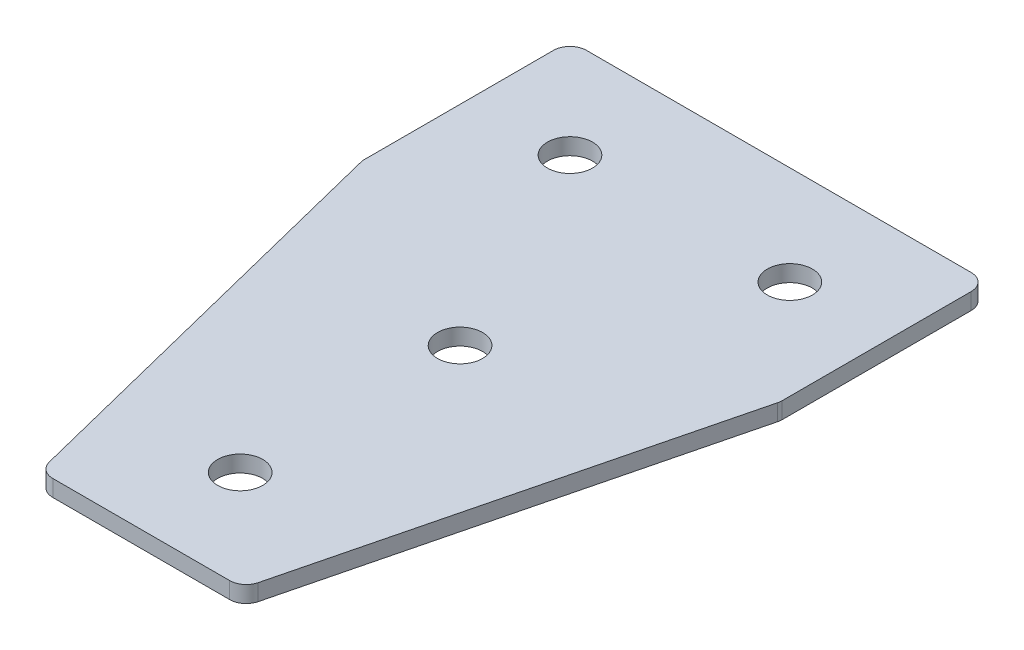
ISO-10303-21;
HEADER;
FILE_DESCRIPTION(('STEP AP214'),'2;1');
FILE_NAME('part.step','',(''),(''),'','','');
FILE_SCHEMA(('AUTOMOTIVE_DESIGN { 1 0 10303 214 1 1 1 1 }'));
ENDSEC;
DATA;
#1=APPLICATION_CONTEXT('core data for automotive mechanical design processes');
#2=APPLICATION_PROTOCOL_DEFINITION('international standard','automotive_design',2000,#1);
#3=PRODUCT_CONTEXT('',#1,'mechanical');
#4=PRODUCT('Part','Part','',(#3));
#5=PRODUCT_RELATED_PRODUCT_CATEGORY('part','',(#4));
#6=PRODUCT_DEFINITION_FORMATION('','',#4);
#7=PRODUCT_DEFINITION_CONTEXT('part definition',#1,'design');
#8=PRODUCT_DEFINITION('design','',#6,#7);
#9=PRODUCT_DEFINITION_SHAPE('','',#8);
#10=(LENGTH_UNIT() NAMED_UNIT(*) SI_UNIT(.MILLI.,.METRE.));
#11=(NAMED_UNIT(*) PLANE_ANGLE_UNIT() SI_UNIT($,.RADIAN.));
#12=(NAMED_UNIT(*) SI_UNIT($,.STERADIAN.) SOLID_ANGLE_UNIT());
#13=UNCERTAINTY_MEASURE_WITH_UNIT(LENGTH_MEASURE(1.E-05),#10,'distance_accuracy_value','');
#14=(GEOMETRIC_REPRESENTATION_CONTEXT(3) GLOBAL_UNCERTAINTY_ASSIGNED_CONTEXT((#13)) GLOBAL_UNIT_ASSIGNED_CONTEXT((#10,
#11,#12)) REPRESENTATION_CONTEXT('',''));
#15=CARTESIAN_POINT('',(0.,0.,0.));
#16=DIRECTION('',(0.,0.,1.));
#17=DIRECTION('',(1.,0.,0.));
#18=AXIS2_PLACEMENT_3D('',#15,#16,#17);
#19=CARTESIAN_POINT('',(-1.93702400832763,1.42462627726309,-40.9871269738255));
#20=DIRECTION('',(0.,-1.,0.));
#21=DIRECTION('',(0.,0.,-1.));
#22=AXIS2_PLACEMENT_3D('',#19,#20,#21);
#23=PLANE('',#22);
#24=CARTESIAN_POINT('',(-1.93702400832764,1.42462627726309,-0.98712697382549));
#25=DIRECTION('',(0.,1.,0.));
#26=DIRECTION('',(0.,0.,1.));
#27=AXIS2_PLACEMENT_3D('',#24,#25,#26);
#28=CIRCLE('',#27,4.1);
#29=CARTESIAN_POINT('',(-1.93702400832764,1.42462627726309,3.11287302617451));
#30=VERTEX_POINT('',#29);
#31=EDGE_CURVE('E171',#30,#30,#28,.T.);
#32=ORIENTED_EDGE('',*,*,#31,.T.);
#33=EDGE_LOOP('',(#32));
#34=FACE_BOUND('',#33,.T.);
#35=DIRECTION('',(1.,0.,0.));
#36=VECTOR('',#35,1.);
#37=CARTESIAN_POINT('',(-19.9370240083276,1.42462627726309,57.0128730261745));
#38=LINE('',#37,#36);
#39=CARTESIAN_POINT('',(-18.0331419763055,1.42462627726309,57.0128730261745));
#40=VERTEX_POINT('',#39);
#41=CARTESIAN_POINT('',(14.1590939596503,1.42462627726309,57.0128730261745));
#42=VERTEX_POINT('',#41);
#43=EDGE_CURVE('E189',#40,#42,#38,.T.);
#44=ORIENTED_EDGE('',*,*,#43,.F.);
#45=CARTESIAN_POINT('',(-18.0331419763055,1.42462627726309,54.0128730261745));
#46=DIRECTION('',(0.,1.,0.));
#47=DIRECTION('',(0.,0.,-1.));
#48=AXIS2_PLACEMENT_3D('',#45,#46,#47);
#49=CIRCLE('',#48,3.);
#50=CARTESIAN_POINT('',(-20.9435694767415,1.42462627726309,54.7404799012835));
#51=VERTEX_POINT('',#50);
#52=EDGE_CURVE('E155',#51,#40,#49,.T.);
#53=ORIENTED_EDGE('',*,*,#52,.F.);
#54=DIRECTION('',(-0.242535625036334,0.,-0.970142500145332));
#55=VECTOR('',#54,1.);
#56=CARTESIAN_POINT('',(-20.3754711955187,1.42462627726309,57.0128730261745));
#57=LINE('',#56,#55);
#58=CARTESIAN_POINT('',(-39.8474515087636,1.42462627726309,-20.8750482268048));
#59=VERTEX_POINT('',#58);
#60=EDGE_CURVE('E142',#51,#59,#57,.T.);
#61=ORIENTED_EDGE('',*,*,#60,.T.);
#62=CARTESIAN_POINT('',(-36.9370240083276,1.42462627726309,-21.6026551019138));
#63=DIRECTION('',(0.,1.,0.));
#64=DIRECTION('',(0.,0.,-1.));
#65=AXIS2_PLACEMENT_3D('',#62,#63,#64);
#66=CIRCLE('',#65,3.);
#67=CARTESIAN_POINT('',(-39.9370240083276,1.42462627726309,-21.6026551019138));
#68=VERTEX_POINT('',#67);
#69=EDGE_CURVE('E153',#68,#59,#66,.T.);
#70=ORIENTED_EDGE('',*,*,#69,.F.);
#71=DIRECTION('',(0.,0.,-1.));
#72=VECTOR('',#71,1.);
#73=CARTESIAN_POINT('',(-39.9370240083276,1.42462627726309,-21.2333382250608));
#74=LINE('',#73,#72);
#75=CARTESIAN_POINT('',(-39.9370240083276,1.42462627726309,-55.9871269738255));
#76=VERTEX_POINT('',#75);
#77=EDGE_CURVE('E124',#68,#76,#74,.T.);
#78=ORIENTED_EDGE('',*,*,#77,.T.);
#79=CARTESIAN_POINT('',(-36.9370240083276,1.42462627726309,-55.9871269738255));
#80=DIRECTION('',(0.,1.,0.));
#81=DIRECTION('',(0.,0.,-1.));
#82=AXIS2_PLACEMENT_3D('',#79,#80,#81);
#83=CIRCLE('',#82,3.);
#84=CARTESIAN_POINT('',(-36.9370240083276,1.42462627726309,-58.9871269738255));
#85=VERTEX_POINT('',#84);
#86=EDGE_CURVE('E150',#85,#76,#83,.T.);
#87=ORIENTED_EDGE('',*,*,#86,.F.);
#88=DIRECTION('',(-1.,0.,0.));
#89=VECTOR('',#88,1.);
#90=CARTESIAN_POINT('',(36.0629759916724,1.42462627726309,-58.9871269738255));
#91=LINE('',#90,#89);
#92=CARTESIAN_POINT('',(33.0629759916724,1.42462627726309,-58.9871269738255));
#93=VERTEX_POINT('',#92);
#94=EDGE_CURVE('E186',#93,#85,#91,.T.);
#95=ORIENTED_EDGE('',*,*,#94,.F.);
#96=CARTESIAN_POINT('',(33.0629759916724,1.42462627726309,-55.9871269738255));
#97=DIRECTION('',(0.,-1.,0.));
#98=DIRECTION('',(0.,0.,-1.));
#99=AXIS2_PLACEMENT_3D('',#96,#97,#98);
#100=CIRCLE('',#99,3.);
#101=CARTESIAN_POINT('',(36.0629759916724,1.42462627726309,-55.9871269738255));
#102=VERTEX_POINT('',#101);
#103=EDGE_CURVE('E210',#93,#102,#100,.T.);
#104=ORIENTED_EDGE('',*,*,#103,.T.);
#105=DIRECTION('',(0.,0.,-1.));
#106=VECTOR('',#105,1.);
#107=CARTESIAN_POINT('',(36.0629759916724,1.42462627726309,-21.2333382250608));
#108=LINE('',#107,#106);
#109=CARTESIAN_POINT('',(36.0629759916724,1.42462627726309,-21.6026551019138));
#110=VERTEX_POINT('',#109);
#111=EDGE_CURVE('E183',#110,#102,#108,.T.);
#112=ORIENTED_EDGE('',*,*,#111,.F.);
#113=CARTESIAN_POINT('',(33.0629759916724,1.42462627726309,-21.6026551019138));
#114=DIRECTION('',(0.,-1.,0.));
#115=DIRECTION('',(0.,0.,-1.));
#116=AXIS2_PLACEMENT_3D('',#113,#114,#115);
#117=CIRCLE('',#116,3.);
#118=CARTESIAN_POINT('',(35.9734034921084,1.42462627726309,-20.8750482268048));
#119=VERTEX_POINT('',#118);
#120=EDGE_CURVE('E31',#110,#119,#117,.T.);
#121=ORIENTED_EDGE('',*,*,#120,.T.);
#122=DIRECTION('',(0.242535625036333,0.,-0.970142500145332));
#123=VECTOR('',#122,1.);
#124=CARTESIAN_POINT('',(16.5014231788635,1.42462627726309,57.0128730261745));
#125=LINE('',#124,#123);
#126=CARTESIAN_POINT('',(17.0695214600863,1.42462627726309,54.7404799012835));
#127=VERTEX_POINT('',#126);
#128=EDGE_CURVE('E191',#127,#119,#125,.T.);
#129=ORIENTED_EDGE('',*,*,#128,.F.);
#130=CARTESIAN_POINT('',(14.1590939596503,1.42462627726309,54.0128730261745));
#131=DIRECTION('',(0.,-1.,0.));
#132=DIRECTION('',(0.,0.,-1.));
#133=AXIS2_PLACEMENT_3D('',#130,#131,#132);
#134=CIRCLE('',#133,3.);
#135=EDGE_CURVE('E213',#127,#42,#134,.T.);
#136=ORIENTED_EDGE('',*,*,#135,.T.);
#137=EDGE_LOOP('',(#44,#53,#61,#70,#78,#87,#95,#104,#112,#121,#129,#136));
#138=FACE_BOUND('',#137,.T.);
#139=CARTESIAN_POINT('',(-1.93702400832764,1.42462627726309,39.0128730261745));
#140=DIRECTION('',(0.,1.,0.));
#141=DIRECTION('',(0.,0.,1.));
#142=AXIS2_PLACEMENT_3D('',#139,#140,#141);
#143=CIRCLE('',#142,4.1);
#144=CARTESIAN_POINT('',(-1.93702400832764,1.42462627726309,43.1128730261745));
#145=VERTEX_POINT('',#144);
#146=EDGE_CURVE('E165',#145,#145,#143,.T.);
#147=ORIENTED_EDGE('',*,*,#146,.T.);
#148=EDGE_LOOP('',(#147));
#149=FACE_BOUND('',#148,.T.);
#150=CARTESIAN_POINT('',(18.0629759916724,1.42462627726309,-40.9871269738255));
#151=DIRECTION('',(0.,1.,0.));
#152=DIRECTION('',(0.,0.,1.));
#153=AXIS2_PLACEMENT_3D('',#150,#151,#152);
#154=CIRCLE('',#153,4.1);
#155=CARTESIAN_POINT('',(18.0629759916724,1.42462627726309,-36.8871269738255));
#156=VERTEX_POINT('',#155);
#157=EDGE_CURVE('E177',#156,#156,#154,.T.);
#158=ORIENTED_EDGE('',*,*,#157,.T.);
#159=EDGE_LOOP('',(#158));
#160=FACE_BOUND('',#159,.T.);
#161=CARTESIAN_POINT('',(-21.9370240083276,1.42462627726309,-40.9871269738255));
#162=DIRECTION('',(0.,-1.,0.));
#163=DIRECTION('',(0.,0.,1.));
#164=AXIS2_PLACEMENT_3D('',#161,#162,#163);
#165=CIRCLE('',#164,4.1);
#166=CARTESIAN_POINT('',(-21.9370240083276,1.42462627726309,-36.8871269738255));
#167=VERTEX_POINT('',#166);
#168=EDGE_CURVE('E135',#167,#167,#165,.T.);
#169=ORIENTED_EDGE('',*,*,#168,.F.);
#170=EDGE_LOOP('',(#169));
#171=FACE_BOUND('',#170,.T.);
#172=ADVANCED_FACE('F16',(#34,#138,#149,#160,#171),#23,.T.);
#173=CARTESIAN_POINT('',(36.0629759916724,1.42462627726309,-21.2333382250608));
#174=DIRECTION('',(1.,0.,0.));
#175=DIRECTION('',(0.,0.,-1.));
#176=AXIS2_PLACEMENT_3D('',#173,#174,#175);
#177=PLANE('',#176);
#178=DIRECTION('',(0.,0.,-1.));
#179=VECTOR('',#178,1.);
#180=CARTESIAN_POINT('',(36.0629759916724,4.42462627726309,-21.2333382250608));
#181=LINE('',#180,#179);
#182=CARTESIAN_POINT('',(36.0629759916724,4.42462627726309,-21.6026551019138));
#183=VERTEX_POINT('',#182);
#184=CARTESIAN_POINT('',(36.0629759916724,4.42462627726309,-55.9871269738255));
#185=VERTEX_POINT('',#184);
#186=EDGE_CURVE('E180',#183,#185,#181,.T.);
#187=ORIENTED_EDGE('',*,*,#186,.F.);
#188=DIRECTION('',(0.,1.,0.));
#189=VECTOR('',#188,1.);
#190=CARTESIAN_POINT('',(36.0629759916724,1.42462627726309,-21.6026551019138));
#191=LINE('',#190,#189);
#192=EDGE_CURVE('E24',#183,#110,#191,.F.);
#193=ORIENTED_EDGE('',*,*,#192,.T.);
#194=ORIENTED_EDGE('',*,*,#111,.T.);
#195=DIRECTION('',(0.,1.,0.));
#196=VECTOR('',#195,1.);
#197=CARTESIAN_POINT('',(36.0629759916724,1.42462627726309,-55.9871269738255));
#198=LINE('',#197,#196);
#199=EDGE_CURVE('E220',#102,#185,#198,.T.);
#200=ORIENTED_EDGE('',*,*,#199,.T.);
#201=EDGE_LOOP('',(#187,#193,#194,#200));
#202=FACE_BOUND('',#201,.T.);
#203=ADVANCED_FACE('F225',(#202),#177,.T.);
#204=CARTESIAN_POINT('',(16.5014231788635,1.42462627726309,57.0128730261745));
#205=DIRECTION('',(0.970142500145332,0.,0.242535625036333));
#206=DIRECTION('',(0.242535625036333,0.,-0.970142500145332));
#207=AXIS2_PLACEMENT_3D('',#204,#205,#206);
#208=PLANE('',#207);
#209=DIRECTION('',(0.242535625036333,0.,-0.970142500145332));
#210=VECTOR('',#209,1.);
#211=CARTESIAN_POINT('',(16.5014231788635,4.42462627726309,57.0128730261745));
#212=LINE('',#211,#210);
#213=CARTESIAN_POINT('',(17.0695214600863,4.42462627726309,54.7404799012835));
#214=VERTEX_POINT('',#213);
#215=CARTESIAN_POINT('',(35.9734034921084,4.42462627726309,-20.8750482268048));
#216=VERTEX_POINT('',#215);
#217=EDGE_CURVE('E187',#214,#216,#212,.T.);
#218=ORIENTED_EDGE('',*,*,#217,.F.);
#219=DIRECTION('',(0.,1.,0.));
#220=VECTOR('',#219,1.);
#221=CARTESIAN_POINT('',(17.0695214600863,1.42462627726309,54.7404799012835));
#222=LINE('',#221,#220);
#223=EDGE_CURVE('E38',#214,#127,#222,.F.);
#224=ORIENTED_EDGE('',*,*,#223,.T.);
#225=ORIENTED_EDGE('',*,*,#128,.T.);
#226=DIRECTION('',(0.,1.,0.));
#227=VECTOR('',#226,1.);
#228=CARTESIAN_POINT('',(35.9734034921084,1.42462627726309,-20.8750482268048));
#229=LINE('',#228,#227);
#230=EDGE_CURVE('E216',#119,#216,#229,.T.);
#231=ORIENTED_EDGE('',*,*,#230,.T.);
#232=EDGE_LOOP('',(#218,#224,#225,#231));
#233=FACE_BOUND('',#232,.T.);
#234=ADVANCED_FACE('F233',(#233),#208,.T.);
#235=CARTESIAN_POINT('',(-19.9370240083276,1.42462627726309,57.0128730261745));
#236=DIRECTION('',(0.,0.,1.));
#237=DIRECTION('',(1.,0.,0.));
#238=AXIS2_PLACEMENT_3D('',#235,#236,#237);
#239=PLANE('',#238);
#240=DIRECTION('',(1.,0.,0.));
#241=VECTOR('',#240,1.);
#242=CARTESIAN_POINT('',(-19.9370240083276,4.42462627726309,57.0128730261745));
#243=LINE('',#242,#241);
#244=CARTESIAN_POINT('',(-18.0331419763055,4.42462627726309,57.0128730261745));
#245=VERTEX_POINT('',#244);
#246=CARTESIAN_POINT('',(14.1590939596503,4.42462627726309,57.0128730261745));
#247=VERTEX_POINT('',#246);
#248=EDGE_CURVE('E198',#245,#247,#243,.T.);
#249=ORIENTED_EDGE('',*,*,#248,.F.);
#250=DIRECTION('',(0.,1.,0.));
#251=VECTOR('',#250,1.);
#252=CARTESIAN_POINT('',(-18.0331419763055,1.42462627726309,57.0128730261745));
#253=LINE('',#252,#251);
#254=EDGE_CURVE('E147',#40,#245,#253,.T.);
#255=ORIENTED_EDGE('',*,*,#254,.F.);
#256=ORIENTED_EDGE('',*,*,#43,.T.);
#257=DIRECTION('',(0.,1.,0.));
#258=VECTOR('',#257,1.);
#259=CARTESIAN_POINT('',(14.1590939596503,1.42462627726309,57.0128730261745));
#260=LINE('',#259,#258);
#261=EDGE_CURVE('E207',#42,#247,#260,.T.);
#262=ORIENTED_EDGE('',*,*,#261,.T.);
#263=EDGE_LOOP('',(#249,#255,#256,#262));
#264=FACE_BOUND('',#263,.T.);
#265=ADVANCED_FACE('F240',(#264),#239,.T.);
#266=CARTESIAN_POINT('',(36.0629759916724,1.42462627726309,-58.9871269738255));
#267=DIRECTION('',(0.,0.,-1.));
#268=DIRECTION('',(-1.,0.,0.));
#269=AXIS2_PLACEMENT_3D('',#266,#267,#268);
#270=PLANE('',#269);
#271=ORIENTED_EDGE('',*,*,#94,.T.);
#272=DIRECTION('',(0.,1.,0.));
#273=VECTOR('',#272,1.);
#274=CARTESIAN_POINT('',(-36.9370240083276,1.42462627726309,-58.9871269738255));
#275=LINE('',#274,#273);
#276=CARTESIAN_POINT('',(-36.9370240083276,4.42462627726309,-58.9871269738255));
#277=VERTEX_POINT('',#276);
#278=EDGE_CURVE('E126',#277,#85,#275,.F.);
#279=ORIENTED_EDGE('',*,*,#278,.F.);
#280=DIRECTION('',(-1.,0.,0.));
#281=VECTOR('',#280,1.);
#282=CARTESIAN_POINT('',(36.0629759916724,4.42462627726309,-58.9871269738255));
#283=LINE('',#282,#281);
#284=CARTESIAN_POINT('',(33.0629759916724,4.42462627726309,-58.9871269738255));
#285=VERTEX_POINT('',#284);
#286=EDGE_CURVE('E196',#285,#277,#283,.T.);
#287=ORIENTED_EDGE('',*,*,#286,.F.);
#288=DIRECTION('',(0.,1.,0.));
#289=VECTOR('',#288,1.);
#290=CARTESIAN_POINT('',(33.0629759916724,1.42462627726309,-58.9871269738255));
#291=LINE('',#290,#289);
#292=EDGE_CURVE('E10',#285,#93,#291,.F.);
#293=ORIENTED_EDGE('',*,*,#292,.T.);
#294=EDGE_LOOP('',(#271,#279,#287,#293));
#295=FACE_BOUND('',#294,.T.);
#296=ADVANCED_FACE('F294',(#295),#270,.T.);
#297=CARTESIAN_POINT('',(-1.93702400832763,4.42462627726309,-40.9871269738255));
#298=DIRECTION('',(0.,-1.,0.));
#299=DIRECTION('',(0.,0.,-1.));
#300=AXIS2_PLACEMENT_3D('',#297,#298,#299);
#301=PLANE('',#300);
#302=CARTESIAN_POINT('',(-1.93702400832764,4.42462627726309,-0.98712697382549));
#303=DIRECTION('',(0.,1.,0.));
#304=DIRECTION('',(0.,0.,1.));
#305=AXIS2_PLACEMENT_3D('',#302,#303,#304);
#306=CIRCLE('',#305,4.1);
#307=CARTESIAN_POINT('',(-1.93702400832764,4.42462627726309,3.11287302617451));
#308=VERTEX_POINT('',#307);
#309=EDGE_CURVE('E168',#308,#308,#306,.T.);
#310=ORIENTED_EDGE('',*,*,#309,.F.);
#311=EDGE_LOOP('',(#310));
#312=FACE_BOUND('',#311,.T.);
#313=CARTESIAN_POINT('',(-18.0331419763055,4.42462627726309,54.0128730261745));
#314=DIRECTION('',(0.,1.,0.));
#315=DIRECTION('',(0.,0.,-1.));
#316=AXIS2_PLACEMENT_3D('',#313,#314,#315);
#317=CIRCLE('',#316,3.);
#318=CARTESIAN_POINT('',(-20.9435694767415,4.42462627726309,54.7404799012835));
#319=VERTEX_POINT('',#318);
#320=EDGE_CURVE('E116',#245,#319,#317,.F.);
#321=ORIENTED_EDGE('',*,*,#320,.F.);
#322=ORIENTED_EDGE('',*,*,#248,.T.);
#323=CARTESIAN_POINT('',(14.1590939596503,4.42462627726309,54.0128730261745));
#324=DIRECTION('',(0.,-1.,0.));
#325=DIRECTION('',(0.,0.,-1.));
#326=AXIS2_PLACEMENT_3D('',#323,#324,#325);
#327=CIRCLE('',#326,3.);
#328=EDGE_CURVE('E205',#247,#214,#327,.F.);
#329=ORIENTED_EDGE('',*,*,#328,.T.);
#330=ORIENTED_EDGE('',*,*,#217,.T.);
#331=CARTESIAN_POINT('',(33.0629759916724,4.42462627726309,-21.6026551019138));
#332=DIRECTION('',(0.,-1.,0.));
#333=DIRECTION('',(0.,0.,-1.));
#334=AXIS2_PLACEMENT_3D('',#331,#332,#333);
#335=CIRCLE('',#334,3.);
#336=EDGE_CURVE('E203',#216,#183,#335,.F.);
#337=ORIENTED_EDGE('',*,*,#336,.T.);
#338=ORIENTED_EDGE('',*,*,#186,.T.);
#339=CARTESIAN_POINT('',(33.0629759916724,4.42462627726309,-55.9871269738255));
#340=DIRECTION('',(0.,-1.,0.));
#341=DIRECTION('',(0.,0.,-1.));
#342=AXIS2_PLACEMENT_3D('',#339,#340,#341);
#343=CIRCLE('',#342,3.);
#344=EDGE_CURVE('E193',#185,#285,#343,.F.);
#345=ORIENTED_EDGE('',*,*,#344,.T.);
#346=ORIENTED_EDGE('',*,*,#286,.T.);
#347=CARTESIAN_POINT('',(-36.9370240083276,4.42462627726309,-55.9871269738255));
#348=DIRECTION('',(0.,1.,0.));
#349=DIRECTION('',(0.,0.,-1.));
#350=AXIS2_PLACEMENT_3D('',#347,#348,#349);
#351=CIRCLE('',#350,3.);
#352=CARTESIAN_POINT('',(-39.9370240083276,4.42462627726309,-55.9871269738255));
#353=VERTEX_POINT('',#352);
#354=EDGE_CURVE('E117',#353,#277,#351,.F.);
#355=ORIENTED_EDGE('',*,*,#354,.F.);
#356=DIRECTION('',(0.,0.,-1.));
#357=VECTOR('',#356,1.);
#358=CARTESIAN_POINT('',(-39.9370240083276,4.42462627726309,-21.2333382250608));
#359=LINE('',#358,#357);
#360=CARTESIAN_POINT('',(-39.9370240083276,4.42462627726309,-21.6026551019138));
#361=VERTEX_POINT('',#360);
#362=EDGE_CURVE('E122',#361,#353,#359,.T.);
#363=ORIENTED_EDGE('',*,*,#362,.F.);
#364=CARTESIAN_POINT('',(-36.9370240083276,4.42462627726309,-21.6026551019138));
#365=DIRECTION('',(0.,1.,0.));
#366=DIRECTION('',(0.,0.,-1.));
#367=AXIS2_PLACEMENT_3D('',#364,#365,#366);
#368=CIRCLE('',#367,3.);
#369=CARTESIAN_POINT('',(-39.8474515087636,4.42462627726309,-20.8750482268048));
#370=VERTEX_POINT('',#369);
#371=EDGE_CURVE('E105',#370,#361,#368,.F.);
#372=ORIENTED_EDGE('',*,*,#371,.F.);
#373=DIRECTION('',(-0.242535625036334,0.,-0.970142500145332));
#374=VECTOR('',#373,1.);
#375=CARTESIAN_POINT('',(-20.3754711955187,4.42462627726309,57.0128730261745));
#376=LINE('',#375,#374);
#377=EDGE_CURVE('E134',#319,#370,#376,.T.);
#378=ORIENTED_EDGE('',*,*,#377,.F.);
#379=EDGE_LOOP('',(#321,#322,#329,#330,#337,#338,#345,#346,#355,#363,#372,#378));
#380=FACE_BOUND('',#379,.T.);
#381=CARTESIAN_POINT('',(-1.93702400832764,4.42462627726309,39.0128730261745));
#382=DIRECTION('',(0.,1.,0.));
#383=DIRECTION('',(0.,0.,1.));
#384=AXIS2_PLACEMENT_3D('',#381,#382,#383);
#385=CIRCLE('',#384,4.1);
#386=CARTESIAN_POINT('',(-1.93702400832764,4.42462627726309,43.1128730261745));
#387=VERTEX_POINT('',#386);
#388=EDGE_CURVE('E164',#387,#387,#385,.T.);
#389=ORIENTED_EDGE('',*,*,#388,.F.);
#390=EDGE_LOOP('',(#389));
#391=FACE_BOUND('',#390,.T.);
#392=CARTESIAN_POINT('',(18.0629759916724,4.42462627726309,-40.9871269738255));
#393=DIRECTION('',(0.,1.,0.));
#394=DIRECTION('',(0.,0.,1.));
#395=AXIS2_PLACEMENT_3D('',#392,#393,#394);
#396=CIRCLE('',#395,4.1);
#397=CARTESIAN_POINT('',(18.0629759916724,4.42462627726309,-36.8871269738255));
#398=VERTEX_POINT('',#397);
#399=EDGE_CURVE('E174',#398,#398,#396,.T.);
#400=ORIENTED_EDGE('',*,*,#399,.F.);
#401=EDGE_LOOP('',(#400));
#402=FACE_BOUND('',#401,.T.);
#403=CARTESIAN_POINT('',(-21.9370240083276,4.42462627726309,-40.9871269738255));
#404=DIRECTION('',(0.,-1.,0.));
#405=DIRECTION('',(0.,0.,1.));
#406=AXIS2_PLACEMENT_3D('',#403,#404,#405);
#407=CIRCLE('',#406,4.1);
#408=CARTESIAN_POINT('',(-21.9370240083276,4.42462627726309,-36.8871269738255));
#409=VERTEX_POINT('',#408);
#410=EDGE_CURVE('E139',#409,#409,#407,.T.);
#411=ORIENTED_EDGE('',*,*,#410,.T.);
#412=EDGE_LOOP('',(#411));
#413=FACE_BOUND('',#412,.T.);
#414=ADVANCED_FACE('F130',(#312,#380,#391,#402,#413),#301,.F.);
#415=CARTESIAN_POINT('',(14.1590939596503,1.42462627726309,54.0128730261745));
#416=DIRECTION('',(0.,1.,0.));
#417=DIRECTION('',(0.,0.,1.));
#418=AXIS2_PLACEMENT_3D('',#415,#416,#417);
#419=CYLINDRICAL_SURFACE('',#418,3.);
#420=ORIENTED_EDGE('',*,*,#135,.F.);
#421=ORIENTED_EDGE('',*,*,#223,.F.);
#422=ORIENTED_EDGE('',*,*,#328,.F.);
#423=ORIENTED_EDGE('',*,*,#261,.F.);
#424=EDGE_LOOP('',(#420,#421,#422,#423));
#425=FACE_BOUND('',#424,.T.);
#426=ADVANCED_FACE('F238',(#425),#419,.T.);
#427=CARTESIAN_POINT('',(33.0629759916724,1.42462627726309,-21.6026551019138));
#428=DIRECTION('',(0.,1.,0.));
#429=DIRECTION('',(0.,0.,1.));
#430=AXIS2_PLACEMENT_3D('',#427,#428,#429);
#431=CYLINDRICAL_SURFACE('',#430,3.);
#432=ORIENTED_EDGE('',*,*,#120,.F.);
#433=ORIENTED_EDGE('',*,*,#192,.F.);
#434=ORIENTED_EDGE('',*,*,#336,.F.);
#435=ORIENTED_EDGE('',*,*,#230,.F.);
#436=EDGE_LOOP('',(#432,#433,#434,#435));
#437=FACE_BOUND('',#436,.T.);
#438=ADVANCED_FACE('F232',(#437),#431,.T.);
#439=CARTESIAN_POINT('',(33.0629759916724,1.42462627726309,-55.9871269738255));
#440=DIRECTION('',(0.,1.,0.));
#441=DIRECTION('',(0.,0.,1.));
#442=AXIS2_PLACEMENT_3D('',#439,#440,#441);
#443=CYLINDRICAL_SURFACE('',#442,3.);
#444=ORIENTED_EDGE('',*,*,#103,.F.);
#445=ORIENTED_EDGE('',*,*,#292,.F.);
#446=ORIENTED_EDGE('',*,*,#344,.F.);
#447=ORIENTED_EDGE('',*,*,#199,.F.);
#448=EDGE_LOOP('',(#444,#445,#446,#447));
#449=FACE_BOUND('',#448,.T.);
#450=ADVANCED_FACE('F18',(#449),#443,.T.);
#451=CARTESIAN_POINT('',(18.0629759916724,1.42462627726309,-40.9871269738255));
#452=DIRECTION('',(0.,1.,0.));
#453=DIRECTION('',(0.,0.,1.));
#454=AXIS2_PLACEMENT_3D('',#451,#452,#453);
#455=CYLINDRICAL_SURFACE('',#454,4.1);
#456=ORIENTED_EDGE('',*,*,#157,.F.);
#457=EDGE_LOOP('',(#456));
#458=FACE_BOUND('',#457,.T.);
#459=ORIENTED_EDGE('',*,*,#399,.T.);
#460=EDGE_LOOP('',(#459));
#461=FACE_BOUND('',#460,.T.);
#462=ADVANCED_FACE('F282',(#458,#461),#455,.F.);
#463=CARTESIAN_POINT('',(-1.93702400832764,1.42462627726309,-0.98712697382549));
#464=DIRECTION('',(0.,1.,0.));
#465=DIRECTION('',(0.,0.,1.));
#466=AXIS2_PLACEMENT_3D('',#463,#464,#465);
#467=CYLINDRICAL_SURFACE('',#466,4.1);
#468=ORIENTED_EDGE('',*,*,#31,.F.);
#469=EDGE_LOOP('',(#468));
#470=FACE_BOUND('',#469,.T.);
#471=ORIENTED_EDGE('',*,*,#309,.T.);
#472=EDGE_LOOP('',(#471));
#473=FACE_BOUND('',#472,.T.);
#474=ADVANCED_FACE('F287',(#470,#473),#467,.F.);
#475=CARTESIAN_POINT('',(-1.93702400832764,1.42462627726309,39.0128730261745));
#476=DIRECTION('',(0.,1.,0.));
#477=DIRECTION('',(0.,0.,1.));
#478=AXIS2_PLACEMENT_3D('',#475,#476,#477);
#479=CYLINDRICAL_SURFACE('',#478,4.1);
#480=ORIENTED_EDGE('',*,*,#388,.T.);
#481=EDGE_LOOP('',(#480));
#482=FACE_BOUND('',#481,.T.);
#483=ORIENTED_EDGE('',*,*,#146,.F.);
#484=EDGE_LOOP('',(#483));
#485=FACE_BOUND('',#484,.T.);
#486=ADVANCED_FACE('F308',(#482,#485),#479,.F.);
#487=CARTESIAN_POINT('',(-39.9370240083276,1.42462627726309,-21.2333382250608));
#488=DIRECTION('',(-1.,0.,0.));
#489=DIRECTION('',(0.,0.,-1.));
#490=AXIS2_PLACEMENT_3D('',#487,#488,#489);
#491=PLANE('',#490);
#492=ORIENTED_EDGE('',*,*,#362,.T.);
#493=DIRECTION('',(0.,1.,0.));
#494=VECTOR('',#493,1.);
#495=CARTESIAN_POINT('',(-39.9370240083276,1.42462627726309,-55.9871269738255));
#496=LINE('',#495,#494);
#497=EDGE_CURVE('E127',#76,#353,#496,.T.);
#498=ORIENTED_EDGE('',*,*,#497,.F.);
#499=ORIENTED_EDGE('',*,*,#77,.F.);
#500=DIRECTION('',(0.,1.,0.));
#501=VECTOR('',#500,1.);
#502=CARTESIAN_POINT('',(-39.9370240083276,1.42462627726309,-21.6026551019138));
#503=LINE('',#502,#501);
#504=EDGE_CURVE('E109',#361,#68,#503,.F.);
#505=ORIENTED_EDGE('',*,*,#504,.F.);
#506=EDGE_LOOP('',(#492,#498,#499,#505));
#507=FACE_BOUND('',#506,.T.);
#508=ADVANCED_FACE('F121',(#507),#491,.T.);
#509=CARTESIAN_POINT('',(-20.3754711955187,1.42462627726309,57.0128730261745));
#510=DIRECTION('',(-0.970142500145332,0.,0.242535625036334));
#511=DIRECTION('',(-0.242535625036334,0.,-0.970142500145332));
#512=AXIS2_PLACEMENT_3D('',#509,#510,#511);
#513=PLANE('',#512);
#514=ORIENTED_EDGE('',*,*,#377,.T.);
#515=DIRECTION('',(0.,1.,0.));
#516=VECTOR('',#515,1.);
#517=CARTESIAN_POINT('',(-39.8474515087636,1.42462627726309,-20.8750482268048));
#518=LINE('',#517,#516);
#519=EDGE_CURVE('E111',#59,#370,#518,.T.);
#520=ORIENTED_EDGE('',*,*,#519,.F.);
#521=ORIENTED_EDGE('',*,*,#60,.F.);
#522=DIRECTION('',(0.,1.,0.));
#523=VECTOR('',#522,1.);
#524=CARTESIAN_POINT('',(-20.9435694767415,1.42462627726309,54.7404799012835));
#525=LINE('',#524,#523);
#526=EDGE_CURVE('E159',#319,#51,#525,.F.);
#527=ORIENTED_EDGE('',*,*,#526,.F.);
#528=EDGE_LOOP('',(#514,#520,#521,#527));
#529=FACE_BOUND('',#528,.T.);
#530=ADVANCED_FACE('F249',(#529),#513,.T.);
#531=CARTESIAN_POINT('',(-18.0331419763055,1.42462627726309,54.0128730261745));
#532=DIRECTION('',(0.,1.,0.));
#533=DIRECTION('',(0.,0.,1.));
#534=AXIS2_PLACEMENT_3D('',#531,#532,#533);
#535=CYLINDRICAL_SURFACE('',#534,3.);
#536=ORIENTED_EDGE('',*,*,#52,.T.);
#537=ORIENTED_EDGE('',*,*,#254,.T.);
#538=ORIENTED_EDGE('',*,*,#320,.T.);
#539=ORIENTED_EDGE('',*,*,#526,.T.);
#540=EDGE_LOOP('',(#536,#537,#538,#539));
#541=FACE_BOUND('',#540,.T.);
#542=ADVANCED_FACE('F246',(#541),#535,.T.);
#543=CARTESIAN_POINT('',(-36.9370240083276,1.42462627726309,-21.6026551019138));
#544=DIRECTION('',(0.,1.,0.));
#545=DIRECTION('',(0.,0.,1.));
#546=AXIS2_PLACEMENT_3D('',#543,#544,#545);
#547=CYLINDRICAL_SURFACE('',#546,3.);
#548=ORIENTED_EDGE('',*,*,#69,.T.);
#549=ORIENTED_EDGE('',*,*,#519,.T.);
#550=ORIENTED_EDGE('',*,*,#371,.T.);
#551=ORIENTED_EDGE('',*,*,#504,.T.);
#552=EDGE_LOOP('',(#548,#549,#550,#551));
#553=FACE_BOUND('',#552,.T.);
#554=ADVANCED_FACE('F108',(#553),#547,.T.);
#555=CARTESIAN_POINT('',(-36.9370240083276,1.42462627726309,-55.9871269738255));
#556=DIRECTION('',(0.,1.,0.));
#557=DIRECTION('',(0.,0.,1.));
#558=AXIS2_PLACEMENT_3D('',#555,#556,#557);
#559=CYLINDRICAL_SURFACE('',#558,3.);
#560=ORIENTED_EDGE('',*,*,#86,.T.);
#561=ORIENTED_EDGE('',*,*,#497,.T.);
#562=ORIENTED_EDGE('',*,*,#354,.T.);
#563=ORIENTED_EDGE('',*,*,#278,.T.);
#564=EDGE_LOOP('',(#560,#561,#562,#563));
#565=FACE_BOUND('',#564,.T.);
#566=ADVANCED_FACE('F258',(#565),#559,.T.);
#567=CARTESIAN_POINT('',(-21.9370240083276,1.42462627726309,-40.9871269738255));
#568=DIRECTION('',(0.,1.,0.));
#569=DIRECTION('',(0.,0.,1.));
#570=AXIS2_PLACEMENT_3D('',#567,#568,#569);
#571=CYLINDRICAL_SURFACE('',#570,4.1);
#572=ORIENTED_EDGE('',*,*,#168,.T.);
#573=EDGE_LOOP('',(#572));
#574=FACE_BOUND('',#573,.T.);
#575=ORIENTED_EDGE('',*,*,#410,.F.);
#576=EDGE_LOOP('',(#575));
#577=FACE_BOUND('',#576,.T.);
#578=ADVANCED_FACE('F256',(#574,#577),#571,.F.);
#579=CLOSED_SHELL('',(#172,#203,#234,#265,#296,#414,#426,#438,#450,#462,#474,#486,#508,#530,
#542,#554,#566,#578));
#580=MANIFOLD_SOLID_BREP('B1',#579);
#581=ADVANCED_BREP_SHAPE_REPRESENTATION('',(#18,#580),#14);
#582=SHAPE_DEFINITION_REPRESENTATION(#9,#581);
ENDSEC;
END-ISO-10303-21;
